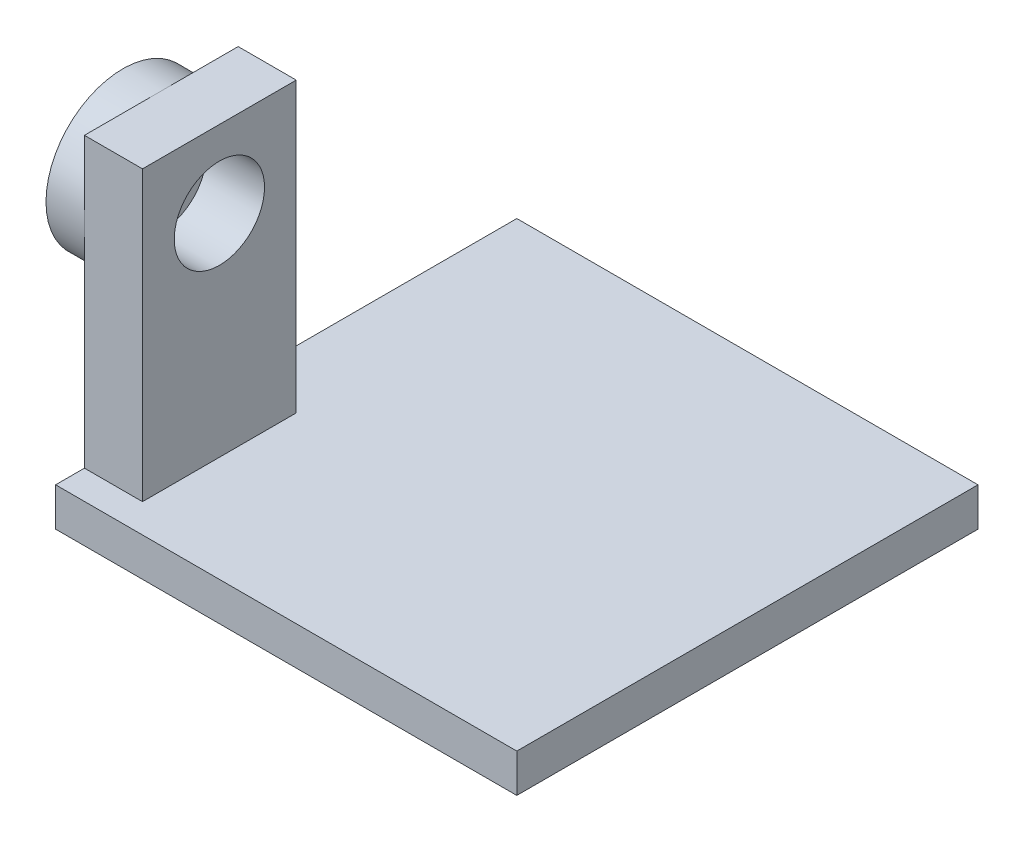
ISO-10303-21;
HEADER;
FILE_DESCRIPTION(('STEP AP214'),'2;1');
FILE_NAME('part.step','',(''),(''),'','','');
FILE_SCHEMA(('AUTOMOTIVE_DESIGN { 1 0 10303 214 1 1 1 1 }'));
ENDSEC;
DATA;
#1=APPLICATION_CONTEXT('core data for automotive mechanical design processes');
#2=APPLICATION_PROTOCOL_DEFINITION('international standard','automotive_design',2000,#1);
#3=PRODUCT_CONTEXT('',#1,'mechanical');
#4=PRODUCT('Part','Part','',(#3));
#5=PRODUCT_RELATED_PRODUCT_CATEGORY('part','',(#4));
#6=PRODUCT_DEFINITION_FORMATION('','',#4);
#7=PRODUCT_DEFINITION_CONTEXT('part definition',#1,'design');
#8=PRODUCT_DEFINITION('design','',#6,#7);
#9=PRODUCT_DEFINITION_SHAPE('','',#8);
#10=(LENGTH_UNIT() NAMED_UNIT(*) SI_UNIT(.MILLI.,.METRE.));
#11=(NAMED_UNIT(*) PLANE_ANGLE_UNIT() SI_UNIT($,.RADIAN.));
#12=(NAMED_UNIT(*) SI_UNIT($,.STERADIAN.) SOLID_ANGLE_UNIT());
#13=UNCERTAINTY_MEASURE_WITH_UNIT(LENGTH_MEASURE(1.E-05),#10,'distance_accuracy_value','');
#14=(GEOMETRIC_REPRESENTATION_CONTEXT(3) GLOBAL_UNCERTAINTY_ASSIGNED_CONTEXT((#13)) GLOBAL_UNIT_ASSIGNED_CONTEXT((#10,
#11,#12)) REPRESENTATION_CONTEXT('',''));
#15=CARTESIAN_POINT('',(0.,0.,0.));
#16=DIRECTION('',(0.,0.,1.));
#17=DIRECTION('',(1.,0.,0.));
#18=AXIS2_PLACEMENT_3D('',#15,#16,#17);
#19=CARTESIAN_POINT('',(-27.9712230215827,13.,5.07553956834533));
#20=DIRECTION('',(-1.,0.,0.));
#21=DIRECTION('',(0.,0.,1.));
#22=AXIS2_PLACEMENT_3D('',#19,#20,#21);
#23=CYLINDRICAL_SURFACE('',#22,1.);
#24=CARTESIAN_POINT('',(-27.9712230215827,13.,5.07553956834533));
#25=DIRECTION('',(-1.,0.,0.));
#26=DIRECTION('',(0.,0.,1.));
#27=AXIS2_PLACEMENT_3D('',#24,#25,#26);
#28=CIRCLE('',#27,1.);
#29=CARTESIAN_POINT('',(-27.9712230215827,13.,6.07553956834533));
#30=VERTEX_POINT('',#29);
#31=EDGE_CURVE('E140',#30,#30,#28,.T.);
#32=ORIENTED_EDGE('',*,*,#31,.F.);
#33=EDGE_LOOP('',(#32));
#34=FACE_BOUND('',#33,.T.);
#35=CARTESIAN_POINT('',(-29.6712230215827,13.,5.07553956834533));
#36=DIRECTION('',(-1.,0.,0.));
#37=DIRECTION('',(0.,0.,1.));
#38=AXIS2_PLACEMENT_3D('',#35,#36,#37);
#39=CIRCLE('',#38,1.);
#40=CARTESIAN_POINT('',(-29.6712230215827,13.,6.07553956834533));
#41=VERTEX_POINT('',#40);
#42=EDGE_CURVE('E42',#41,#41,#39,.F.);
#43=ORIENTED_EDGE('',*,*,#42,.F.);
#44=EDGE_LOOP('',(#43));
#45=FACE_BOUND('',#44,.T.);
#46=ADVANCED_FACE('F38',(#34,#45),#23,.F.);
#47=CARTESIAN_POINT('',(-27.9712230215827,2.,-13.4244604316547));
#48=DIRECTION('',(1.,0.,0.));
#49=DIRECTION('',(0.,0.,-1.));
#50=AXIS2_PLACEMENT_3D('',#47,#48,#49);
#51=PLANE('',#50);
#52=CARTESIAN_POINT('',(-27.9712230215827,13.,5.07553956834533));
#53=DIRECTION('',(-1.,0.,0.));
#54=DIRECTION('',(0.,0.,1.));
#55=AXIS2_PLACEMENT_3D('',#52,#53,#54);
#56=CIRCLE('',#55,4.);
#57=CARTESIAN_POINT('',(-27.9712230215827,13.,9.07553956834533));
#58=VERTEX_POINT('',#57);
#59=CARTESIAN_POINT('',(-27.9712230215827,17.,5.07553956834533));
#60=VERTEX_POINT('',#59);
#61=EDGE_CURVE('E50',#58,#60,#56,.T.);
#62=ORIENTED_EDGE('',*,*,#61,.F.);
#63=DIRECTION('',(0.,-1.,0.));
#64=VECTOR('',#63,1.);
#65=CARTESIAN_POINT('',(-27.9712230215827,17.,9.07553956834533));
#66=LINE('',#65,#64);
#67=CARTESIAN_POINT('',(-27.9712230215827,17.,9.07553956834533));
#68=VERTEX_POINT('',#67);
#69=EDGE_CURVE('E116',#68,#58,#66,.T.);
#70=ORIENTED_EDGE('',*,*,#69,.F.);
#71=DIRECTION('',(0.,0.,1.));
#72=VECTOR('',#71,1.);
#73=CARTESIAN_POINT('',(-27.9712230215827,17.,1.07553956834533));
#74=LINE('',#73,#72);
#75=EDGE_CURVE('E135',#60,#68,#74,.T.);
#76=ORIENTED_EDGE('',*,*,#75,.F.);
#77=EDGE_LOOP('',(#62,#70,#76));
#78=FACE_BOUND('',#77,.T.);
#79=ADVANCED_FACE('F134',(#78),#51,.F.);
#80=CARTESIAN_POINT('',(-27.9712230215827,13.,1.07553956834533));
#81=VERTEX_POINT('',#80);
#82=EDGE_CURVE('E11',#60,#81,#56,.T.);
#83=ORIENTED_EDGE('',*,*,#82,.F.);
#84=CARTESIAN_POINT('',(-27.9712230215827,17.,1.07553956834533));
#85=VERTEX_POINT('',#84);
#86=EDGE_CURVE('E167',#85,#60,#74,.T.);
#87=ORIENTED_EDGE('',*,*,#86,.F.);
#88=DIRECTION('',(0.,-1.,0.));
#89=VECTOR('',#88,1.);
#90=CARTESIAN_POINT('',(-27.9712230215827,17.,1.07553956834533));
#91=LINE('',#90,#89);
#92=EDGE_CURVE('E184',#85,#81,#91,.T.);
#93=ORIENTED_EDGE('',*,*,#92,.T.);
#94=EDGE_LOOP('',(#83,#87,#93));
#95=FACE_BOUND('',#94,.T.);
#96=ADVANCED_FACE('F300',(#95),#51,.F.);
#97=EDGE_CURVE('E48',#81,#58,#56,.T.);
#98=ORIENTED_EDGE('',*,*,#97,.F.);
#99=CARTESIAN_POINT('',(-27.9712230215827,2.,1.07553956834533));
#100=VERTEX_POINT('',#99);
#101=EDGE_CURVE('E126',#81,#100,#91,.T.);
#102=ORIENTED_EDGE('',*,*,#101,.T.);
#103=DIRECTION('',(0.,0.,1.));
#104=VECTOR('',#103,1.);
#105=CARTESIAN_POINT('',(-27.9712230215827,2.,-13.4244604316547));
#106=LINE('',#105,#104);
#107=CARTESIAN_POINT('',(-27.9712230215827,2.,-13.4244604316547));
#108=VERTEX_POINT('',#107);
#109=EDGE_CURVE('E192',#108,#100,#106,.T.);
#110=ORIENTED_EDGE('',*,*,#109,.F.);
#111=DIRECTION('',(0.,-1.,0.));
#112=VECTOR('',#111,1.);
#113=CARTESIAN_POINT('',(-27.9712230215827,2.,-13.4244604316547));
#114=LINE('',#113,#112);
#115=CARTESIAN_POINT('',(-27.9712230215827,0.,-13.4244604316547));
#116=VERTEX_POINT('',#115);
#117=EDGE_CURVE('E205',#108,#116,#114,.T.);
#118=ORIENTED_EDGE('',*,*,#117,.T.);
#119=DIRECTION('',(0.,0.,1.));
#120=VECTOR('',#119,1.);
#121=CARTESIAN_POINT('',(-27.9712230215827,0.,-13.4244604316547));
#122=LINE('',#121,#120);
#123=CARTESIAN_POINT('',(-27.9712230215827,0.,10.5755395683453));
#124=VERTEX_POINT('',#123);
#125=EDGE_CURVE('E191',#116,#124,#122,.T.);
#126=ORIENTED_EDGE('',*,*,#125,.T.);
#127=DIRECTION('',(0.,-1.,0.));
#128=VECTOR('',#127,1.);
#129=CARTESIAN_POINT('',(-27.9712230215827,2.,10.5755395683453));
#130=LINE('',#129,#128);
#131=CARTESIAN_POINT('',(-27.9712230215827,2.,10.5755395683453));
#132=VERTEX_POINT('',#131);
#133=EDGE_CURVE('E143',#132,#124,#130,.T.);
#134=ORIENTED_EDGE('',*,*,#133,.F.);
#135=CARTESIAN_POINT('',(-27.9712230215827,2.,9.07553956834533));
#136=VERTEX_POINT('',#135);
#137=EDGE_CURVE('E130',#136,#132,#106,.T.);
#138=ORIENTED_EDGE('',*,*,#137,.F.);
#139=EDGE_CURVE('E119',#58,#136,#66,.T.);
#140=ORIENTED_EDGE('',*,*,#139,.F.);
#141=EDGE_LOOP('',(#98,#102,#110,#118,#126,#134,#138,#140));
#142=FACE_BOUND('',#141,.T.);
#143=ADVANCED_FACE('F40',(#142),#51,.F.);
#144=CARTESIAN_POINT('',(-27.9712230215827,2.,10.5755395683453));
#145=DIRECTION('',(0.,0.,-1.));
#146=DIRECTION('',(-1.,0.,0.));
#147=AXIS2_PLACEMENT_3D('',#144,#145,#146);
#148=PLANE('',#147);
#149=DIRECTION('',(1.,0.,0.));
#150=VECTOR('',#149,1.);
#151=CARTESIAN_POINT('',(-27.9712230215827,0.,10.5755395683453));
#152=LINE('',#151,#150);
#153=CARTESIAN_POINT('',(-3.97122302158273,0.,10.5755395683453));
#154=VERTEX_POINT('',#153);
#155=EDGE_CURVE('E209',#124,#154,#152,.T.);
#156=ORIENTED_EDGE('',*,*,#155,.T.);
#157=DIRECTION('',(0.,-1.,0.));
#158=VECTOR('',#157,1.);
#159=CARTESIAN_POINT('',(-3.97122302158273,2.,10.5755395683453));
#160=LINE('',#159,#158);
#161=CARTESIAN_POINT('',(-3.97122302158273,2.,10.5755395683453));
#162=VERTEX_POINT('',#161);
#163=EDGE_CURVE('E146',#162,#154,#160,.T.);
#164=ORIENTED_EDGE('',*,*,#163,.F.);
#165=DIRECTION('',(1.,0.,0.));
#166=VECTOR('',#165,1.);
#167=CARTESIAN_POINT('',(-27.9712230215827,2.,10.5755395683453));
#168=LINE('',#167,#166);
#169=EDGE_CURVE('E196',#132,#162,#168,.T.);
#170=ORIENTED_EDGE('',*,*,#169,.F.);
#171=ORIENTED_EDGE('',*,*,#133,.T.);
#172=EDGE_LOOP('',(#156,#164,#170,#171));
#173=FACE_BOUND('',#172,.T.);
#174=ADVANCED_FACE('F367',(#173),#148,.F.);
#175=CARTESIAN_POINT('',(-3.97122302158273,2.,-13.4244604316547));
#176=DIRECTION('',(-1.,0.,0.));
#177=DIRECTION('',(0.,0.,1.));
#178=AXIS2_PLACEMENT_3D('',#175,#176,#177);
#179=PLANE('',#178);
#180=DIRECTION('',(0.,0.,-1.));
#181=VECTOR('',#180,1.);
#182=CARTESIAN_POINT('',(-3.97122302158273,0.,-13.4244604316547));
#183=LINE('',#182,#181);
#184=CARTESIAN_POINT('',(-3.97122302158273,0.,-13.4244604316547));
#185=VERTEX_POINT('',#184);
#186=EDGE_CURVE('E212',#154,#185,#183,.T.);
#187=ORIENTED_EDGE('',*,*,#186,.T.);
#188=DIRECTION('',(0.,-1.,0.));
#189=VECTOR('',#188,1.);
#190=CARTESIAN_POINT('',(-3.97122302158273,2.,-13.4244604316547));
#191=LINE('',#190,#189);
#192=CARTESIAN_POINT('',(-3.97122302158273,2.,-13.4244604316547));
#193=VERTEX_POINT('',#192);
#194=EDGE_CURVE('E221',#193,#185,#191,.T.);
#195=ORIENTED_EDGE('',*,*,#194,.F.);
#196=DIRECTION('',(0.,0.,-1.));
#197=VECTOR('',#196,1.);
#198=CARTESIAN_POINT('',(-3.97122302158273,2.,-13.4244604316547));
#199=LINE('',#198,#197);
#200=EDGE_CURVE('E199',#162,#193,#199,.T.);
#201=ORIENTED_EDGE('',*,*,#200,.F.);
#202=ORIENTED_EDGE('',*,*,#163,.T.);
#203=EDGE_LOOP('',(#187,#195,#201,#202));
#204=FACE_BOUND('',#203,.T.);
#205=ADVANCED_FACE('F231',(#204),#179,.F.);
#206=CARTESIAN_POINT('',(-27.9712230215827,2.,-13.4244604316547));
#207=DIRECTION('',(0.,0.,1.));
#208=DIRECTION('',(1.,0.,0.));
#209=AXIS2_PLACEMENT_3D('',#206,#207,#208);
#210=PLANE('',#209);
#211=DIRECTION('',(-1.,0.,0.));
#212=VECTOR('',#211,1.);
#213=CARTESIAN_POINT('',(-27.9712230215827,0.,-13.4244604316547));
#214=LINE('',#213,#212);
#215=EDGE_CURVE('E215',#185,#116,#214,.T.);
#216=ORIENTED_EDGE('',*,*,#215,.T.);
#217=ORIENTED_EDGE('',*,*,#117,.F.);
#218=DIRECTION('',(-1.,0.,0.));
#219=VECTOR('',#218,1.);
#220=CARTESIAN_POINT('',(-27.9712230215827,2.,-13.4244604316547));
#221=LINE('',#220,#219);
#222=EDGE_CURVE('E202',#193,#108,#221,.T.);
#223=ORIENTED_EDGE('',*,*,#222,.F.);
#224=ORIENTED_EDGE('',*,*,#194,.T.);
#225=EDGE_LOOP('',(#216,#217,#223,#224));
#226=FACE_BOUND('',#225,.T.);
#227=ADVANCED_FACE('F241',(#226),#210,.F.);
#228=CARTESIAN_POINT('',(0.,2.,0.));
#229=DIRECTION('',(0.,1.,0.));
#230=DIRECTION('',(0.,0.,1.));
#231=AXIS2_PLACEMENT_3D('',#228,#229,#230);
#232=PLANE('',#231);
#233=DIRECTION('',(1.,0.,0.));
#234=VECTOR('',#233,1.);
#235=CARTESIAN_POINT('',(-27.9712230215827,2.,9.07553956834533));
#236=LINE('',#235,#234);
#237=CARTESIAN_POINT('',(-24.9492492147988,2.,9.07553956834533));
#238=VERTEX_POINT('',#237);
#239=EDGE_CURVE('E164',#136,#238,#236,.T.);
#240=ORIENTED_EDGE('',*,*,#239,.F.);
#241=ORIENTED_EDGE('',*,*,#137,.T.);
#242=ORIENTED_EDGE('',*,*,#169,.T.);
#243=ORIENTED_EDGE('',*,*,#200,.T.);
#244=ORIENTED_EDGE('',*,*,#222,.T.);
#245=ORIENTED_EDGE('',*,*,#109,.T.);
#246=DIRECTION('',(-1.,0.,0.));
#247=VECTOR('',#246,1.);
#248=CARTESIAN_POINT('',(-27.9712230215827,2.,1.07553956834533));
#249=LINE('',#248,#247);
#250=CARTESIAN_POINT('',(-24.9492492147988,2.,1.07553956834533));
#251=VERTEX_POINT('',#250);
#252=EDGE_CURVE('E175',#251,#100,#249,.T.);
#253=ORIENTED_EDGE('',*,*,#252,.F.);
#254=DIRECTION('',(0.,0.,-1.));
#255=VECTOR('',#254,1.);
#256=CARTESIAN_POINT('',(-24.9492492147988,2.,1.07553956834533));
#257=LINE('',#256,#255);
#258=EDGE_CURVE('E158',#238,#251,#257,.T.);
#259=ORIENTED_EDGE('',*,*,#258,.F.);
#260=EDGE_LOOP('',(#240,#241,#242,#243,#244,#245,#253,#259));
#261=FACE_BOUND('',#260,.T.);
#262=ADVANCED_FACE('F245',(#261),#232,.T.);
#263=CARTESIAN_POINT('',(0.,0.,0.));
#264=DIRECTION('',(0.,1.,0.));
#265=DIRECTION('',(0.,0.,1.));
#266=AXIS2_PLACEMENT_3D('',#263,#264,#265);
#267=PLANE('',#266);
#268=ORIENTED_EDGE('',*,*,#125,.F.);
#269=ORIENTED_EDGE('',*,*,#215,.F.);
#270=ORIENTED_EDGE('',*,*,#186,.F.);
#271=ORIENTED_EDGE('',*,*,#155,.F.);
#272=EDGE_LOOP('',(#268,#269,#270,#271));
#273=FACE_BOUND('',#272,.T.);
#274=ADVANCED_FACE('F238',(#273),#267,.F.);
#275=CARTESIAN_POINT('',(-24.9492492147988,17.,1.07553956834533));
#276=DIRECTION('',(-1.,0.,0.));
#277=DIRECTION('',(0.,0.,1.));
#278=AXIS2_PLACEMENT_3D('',#275,#276,#277);
#279=PLANE('',#278);
#280=CARTESIAN_POINT('',(-24.9492492147988,13.,5.07553956834533));
#281=DIRECTION('',(1.,0.,0.));
#282=DIRECTION('',(0.,0.,-1.));
#283=AXIS2_PLACEMENT_3D('',#280,#281,#282);
#284=CIRCLE('',#283,2.35);
#285=CARTESIAN_POINT('',(-24.9492492147988,13.,2.72553956834533));
#286=VERTEX_POINT('',#285);
#287=EDGE_CURVE('E150',#286,#286,#284,.T.);
#288=ORIENTED_EDGE('',*,*,#287,.F.);
#289=EDGE_LOOP('',(#288));
#290=FACE_BOUND('',#289,.T.);
#291=ORIENTED_EDGE('',*,*,#258,.T.);
#292=DIRECTION('',(0.,-1.,0.));
#293=VECTOR('',#292,1.);
#294=CARTESIAN_POINT('',(-24.9492492147988,17.,1.07553956834533));
#295=LINE('',#294,#293);
#296=CARTESIAN_POINT('',(-24.9492492147988,17.,1.07553956834533));
#297=VERTEX_POINT('',#296);
#298=EDGE_CURVE('E187',#297,#251,#295,.T.);
#299=ORIENTED_EDGE('',*,*,#298,.F.);
#300=DIRECTION('',(0.,0.,-1.));
#301=VECTOR('',#300,1.);
#302=CARTESIAN_POINT('',(-24.9492492147988,17.,1.07553956834533));
#303=LINE('',#302,#301);
#304=CARTESIAN_POINT('',(-24.9492492147988,17.,9.07553956834533));
#305=VERTEX_POINT('',#304);
#306=EDGE_CURVE('E159',#305,#297,#303,.T.);
#307=ORIENTED_EDGE('',*,*,#306,.F.);
#308=DIRECTION('',(0.,-1.,0.));
#309=VECTOR('',#308,1.);
#310=CARTESIAN_POINT('',(-24.9492492147988,17.,9.07553956834533));
#311=LINE('',#310,#309);
#312=EDGE_CURVE('E132',#305,#238,#311,.T.);
#313=ORIENTED_EDGE('',*,*,#312,.T.);
#314=EDGE_LOOP('',(#291,#299,#307,#313));
#315=FACE_BOUND('',#314,.T.);
#316=ADVANCED_FACE('F252',(#290,#315),#279,.F.);
#317=CARTESIAN_POINT('',(-27.9712230215827,17.,1.07553956834533));
#318=DIRECTION('',(0.,0.,1.));
#319=DIRECTION('',(1.,0.,0.));
#320=AXIS2_PLACEMENT_3D('',#317,#318,#319);
#321=PLANE('',#320);
#322=ORIENTED_EDGE('',*,*,#252,.T.);
#323=ORIENTED_EDGE('',*,*,#101,.F.);
#324=ORIENTED_EDGE('',*,*,#92,.F.);
#325=DIRECTION('',(-1.,0.,0.));
#326=VECTOR('',#325,1.);
#327=CARTESIAN_POINT('',(-27.9712230215827,17.,1.07553956834533));
#328=LINE('',#327,#326);
#329=EDGE_CURVE('E163',#297,#85,#328,.T.);
#330=ORIENTED_EDGE('',*,*,#329,.F.);
#331=ORIENTED_EDGE('',*,*,#298,.T.);
#332=EDGE_LOOP('',(#322,#323,#324,#330,#331));
#333=FACE_BOUND('',#332,.T.);
#334=ADVANCED_FACE('F247',(#333),#321,.F.);
#335=CARTESIAN_POINT('',(-27.9712230215827,17.,9.07553956834533));
#336=DIRECTION('',(0.,0.,-1.));
#337=DIRECTION('',(-1.,0.,0.));
#338=AXIS2_PLACEMENT_3D('',#335,#336,#337);
#339=PLANE('',#338);
#340=ORIENTED_EDGE('',*,*,#239,.T.);
#341=ORIENTED_EDGE('',*,*,#312,.F.);
#342=DIRECTION('',(1.,0.,0.));
#343=VECTOR('',#342,1.);
#344=CARTESIAN_POINT('',(-27.9712230215827,17.,9.07553956834533));
#345=LINE('',#344,#343);
#346=EDGE_CURVE('E122',#68,#305,#345,.T.);
#347=ORIENTED_EDGE('',*,*,#346,.F.);
#348=ORIENTED_EDGE('',*,*,#69,.T.);
#349=ORIENTED_EDGE('',*,*,#139,.T.);
#350=EDGE_LOOP('',(#340,#341,#347,#348,#349));
#351=FACE_BOUND('',#350,.T.);
#352=ADVANCED_FACE('F118',(#351),#339,.F.);
#353=CARTESIAN_POINT('',(0.,17.,0.));
#354=DIRECTION('',(0.,1.,0.));
#355=DIRECTION('',(0.,0.,1.));
#356=AXIS2_PLACEMENT_3D('',#353,#354,#355);
#357=PLANE('',#356);
#358=ORIENTED_EDGE('',*,*,#306,.T.);
#359=ORIENTED_EDGE('',*,*,#329,.T.);
#360=ORIENTED_EDGE('',*,*,#86,.T.);
#361=ORIENTED_EDGE('',*,*,#75,.T.);
#362=ORIENTED_EDGE('',*,*,#346,.T.);
#363=EDGE_LOOP('',(#358,#359,#360,#361,#362));
#364=FACE_BOUND('',#363,.T.);
#365=ADVANCED_FACE('F254',(#364),#357,.T.);
#366=CARTESIAN_POINT('',(-28.1492492147988,13.,5.07553956834533));
#367=DIRECTION('',(1.,0.,0.));
#368=DIRECTION('',(0.,0.,-1.));
#369=AXIS2_PLACEMENT_3D('',#366,#367,#368);
#370=CYLINDRICAL_SURFACE('',#369,2.35);
#371=ORIENTED_EDGE('',*,*,#287,.T.);
#372=EDGE_LOOP('',(#371));
#373=FACE_BOUND('',#372,.T.);
#374=CARTESIAN_POINT('',(-27.9712230215827,13.,5.07553956834533));
#375=DIRECTION('',(1.,0.,0.));
#376=DIRECTION('',(0.,0.,-1.));
#377=AXIS2_PLACEMENT_3D('',#374,#375,#376);
#378=CIRCLE('',#377,2.35);
#379=CARTESIAN_POINT('',(-27.9712230215827,13.,2.72553956834533));
#380=VERTEX_POINT('',#379);
#381=EDGE_CURVE('E154',#380,#380,#378,.T.);
#382=ORIENTED_EDGE('',*,*,#381,.F.);
#383=EDGE_LOOP('',(#382));
#384=FACE_BOUND('',#383,.T.);
#385=ADVANCED_FACE('F277',(#373,#384),#370,.F.);
#386=CARTESIAN_POINT('',(-29.9712230215827,13.,5.07553956834533));
#387=DIRECTION('',(-1.,0.,0.));
#388=DIRECTION('',(0.,0.,1.));
#389=AXIS2_PLACEMENT_3D('',#386,#387,#388);
#390=PLANE('',#389);
#391=CARTESIAN_POINT('',(-29.9712230215827,13.,5.07553956834533));
#392=DIRECTION('',(-1.,0.,0.));
#393=DIRECTION('',(0.,0.,1.));
#394=AXIS2_PLACEMENT_3D('',#391,#392,#393);
#395=CIRCLE('',#394,1.25);
#396=CARTESIAN_POINT('',(-29.9712230215827,13.,6.32553956834533));
#397=VERTEX_POINT('',#396);
#398=EDGE_CURVE('E266',#397,#397,#395,.T.);
#399=ORIENTED_EDGE('',*,*,#398,.F.);
#400=EDGE_LOOP('',(#399));
#401=FACE_BOUND('',#400,.T.);
#402=CARTESIAN_POINT('',(-29.9712230215827,13.,5.07553956834533));
#403=DIRECTION('',(-1.,0.,0.));
#404=DIRECTION('',(0.,0.,1.));
#405=AXIS2_PLACEMENT_3D('',#402,#403,#404);
#406=CIRCLE('',#405,4.);
#407=CARTESIAN_POINT('',(-29.9712230215827,13.,9.07553956834533));
#408=VERTEX_POINT('',#407);
#409=EDGE_CURVE('E139',#408,#408,#406,.T.);
#410=ORIENTED_EDGE('',*,*,#409,.T.);
#411=EDGE_LOOP('',(#410));
#412=FACE_BOUND('',#411,.T.);
#413=ADVANCED_FACE('F274',(#401,#412),#390,.T.);
#414=CARTESIAN_POINT('',(-29.9712230215827,13.,5.07553956834533));
#415=DIRECTION('',(1.,0.,0.));
#416=DIRECTION('',(0.,0.,-1.));
#417=AXIS2_PLACEMENT_3D('',#414,#415,#416);
#418=CYLINDRICAL_SURFACE('',#417,4.);
#419=ORIENTED_EDGE('',*,*,#409,.F.);
#420=EDGE_LOOP('',(#419));
#421=FACE_BOUND('',#420,.T.);
#422=ORIENTED_EDGE('',*,*,#61,.T.);
#423=ORIENTED_EDGE('',*,*,#82,.T.);
#424=ORIENTED_EDGE('',*,*,#97,.T.);
#425=EDGE_LOOP('',(#422,#423,#424));
#426=FACE_BOUND('',#425,.T.);
#427=ADVANCED_FACE('F141',(#421,#426),#418,.T.);
#428=CARTESIAN_POINT('',(-27.9712230215827,13.,5.07553956834533));
#429=DIRECTION('',(-1.,0.,0.));
#430=DIRECTION('',(0.,0.,1.));
#431=AXIS2_PLACEMENT_3D('',#428,#429,#430);
#432=PLANE('',#431);
#433=ORIENTED_EDGE('',*,*,#31,.T.);
#434=EDGE_LOOP('',(#433));
#435=FACE_BOUND('',#434,.T.);
#436=ORIENTED_EDGE('',*,*,#381,.T.);
#437=EDGE_LOOP('',(#436));
#438=FACE_BOUND('',#437,.T.);
#439=ADVANCED_FACE('F282',(#435,#438),#432,.F.);
#440=CARTESIAN_POINT('',(-29.6712230215827,13.,5.07553956834533));
#441=DIRECTION('',(-1.,0.,0.));
#442=DIRECTION('',(0.,0.,1.));
#443=AXIS2_PLACEMENT_3D('',#440,#441,#442);
#444=PLANE('',#443);
#445=CARTESIAN_POINT('',(-29.6712230215827,13.,5.07553956834533));
#446=DIRECTION('',(-1.,0.,0.));
#447=DIRECTION('',(0.,0.,1.));
#448=AXIS2_PLACEMENT_3D('',#445,#446,#447);
#449=CIRCLE('',#448,1.25);
#450=CARTESIAN_POINT('',(-29.6712230215827,13.,6.32553956834533));
#451=VERTEX_POINT('',#450);
#452=EDGE_CURVE('E263',#451,#451,#449,.T.);
#453=ORIENTED_EDGE('',*,*,#452,.T.);
#454=EDGE_LOOP('',(#453));
#455=FACE_BOUND('',#454,.T.);
#456=ORIENTED_EDGE('',*,*,#42,.T.);
#457=EDGE_LOOP('',(#456));
#458=FACE_BOUND('',#457,.T.);
#459=ADVANCED_FACE('F289',(#455,#458),#444,.T.);
#460=CARTESIAN_POINT('',(-29.6712230215827,13.,5.07553956834533));
#461=DIRECTION('',(-1.,0.,0.));
#462=DIRECTION('',(0.,0.,1.));
#463=AXIS2_PLACEMENT_3D('',#460,#461,#462);
#464=CYLINDRICAL_SURFACE('',#463,1.25);
#465=ORIENTED_EDGE('',*,*,#452,.F.);
#466=EDGE_LOOP('',(#465));
#467=FACE_BOUND('',#466,.T.);
#468=ORIENTED_EDGE('',*,*,#398,.T.);
#469=EDGE_LOOP('',(#468));
#470=FACE_BOUND('',#469,.T.);
#471=ADVANCED_FACE('F272',(#467,#470),#464,.F.);
#472=CLOSED_SHELL('',(#46,#79,#96,#143,#174,#205,#227,#262,#274,#316,#334,#352,#365,#385,#413,
#427,#439,#459,#471));
#473=MANIFOLD_SOLID_BREP('B2',#472);
#474=ADVANCED_BREP_SHAPE_REPRESENTATION('',(#18,#473),#14);
#475=SHAPE_DEFINITION_REPRESENTATION(#9,#474);
ENDSEC;
END-ISO-10303-21;
